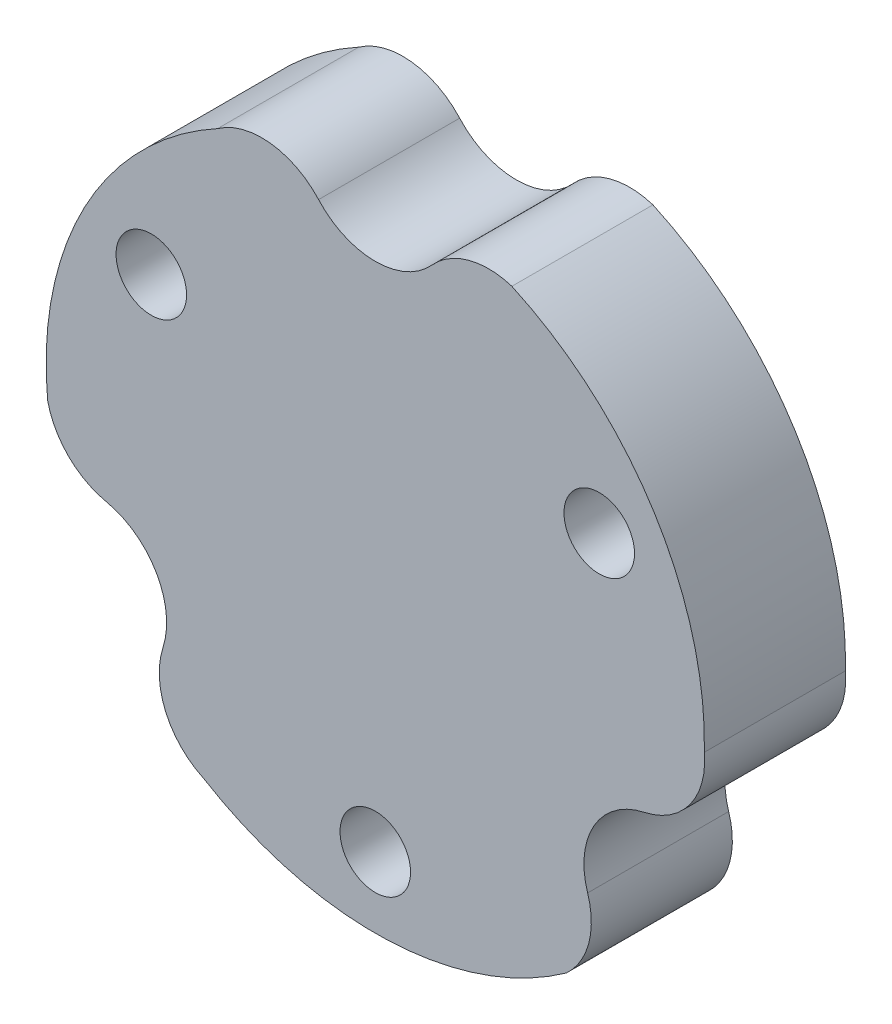
ISO-10303-21;
HEADER;
FILE_DESCRIPTION(('STEP AP214'),'2;1');
FILE_NAME('part.step','',(''),(''),'','','');
FILE_SCHEMA(('AUTOMOTIVE_DESIGN { 1 0 10303 214 1 1 1 1 }'));
ENDSEC;
DATA;
#1=APPLICATION_CONTEXT('core data for automotive mechanical design processes');
#2=APPLICATION_PROTOCOL_DEFINITION('international standard','automotive_design',2000,#1);
#3=PRODUCT_CONTEXT('',#1,'mechanical');
#4=PRODUCT('Part','Part','',(#3));
#5=PRODUCT_RELATED_PRODUCT_CATEGORY('part','',(#4));
#6=PRODUCT_DEFINITION_FORMATION('','',#4);
#7=PRODUCT_DEFINITION_CONTEXT('part definition',#1,'design');
#8=PRODUCT_DEFINITION('design','',#6,#7);
#9=PRODUCT_DEFINITION_SHAPE('','',#8);
#10=(LENGTH_UNIT() NAMED_UNIT(*) SI_UNIT(.MILLI.,.METRE.));
#11=(NAMED_UNIT(*) PLANE_ANGLE_UNIT() SI_UNIT($,.RADIAN.));
#12=(NAMED_UNIT(*) SI_UNIT($,.STERADIAN.) SOLID_ANGLE_UNIT());
#13=UNCERTAINTY_MEASURE_WITH_UNIT(LENGTH_MEASURE(1.E-05),#10,'distance_accuracy_value','');
#14=(GEOMETRIC_REPRESENTATION_CONTEXT(3) GLOBAL_UNCERTAINTY_ASSIGNED_CONTEXT((#13)) GLOBAL_UNIT_ASSIGNED_CONTEXT((#10,
#11,#12)) REPRESENTATION_CONTEXT('',''));
#15=CARTESIAN_POINT('',(0.,0.,0.));
#16=DIRECTION('',(0.,0.,1.));
#17=DIRECTION('',(1.,0.,0.));
#18=AXIS2_PLACEMENT_3D('',#15,#16,#17);
#19=CARTESIAN_POINT('',(5.38035373757222,-0.322325392410559,6.));
#20=DIRECTION('',(0.,0.,1.));
#21=DIRECTION('',(1.,0.,0.));
#22=AXIS2_PLACEMENT_3D('',#19,#20,#21);
#23=PLANE('',#22);
#24=CARTESIAN_POINT('',(0.,-11.,6.));
#25=DIRECTION('',(0.,0.,1.));
#26=DIRECTION('',(1.,0.,0.));
#27=AXIS2_PLACEMENT_3D('',#24,#25,#26);
#28=CIRCLE('',#27,1.5);
#29=CARTESIAN_POINT('',(1.5,-11.,6.));
#30=VERTEX_POINT('',#29);
#31=EDGE_CURVE('E286',#30,#30,#28,.T.);
#32=ORIENTED_EDGE('',*,*,#31,.F.);
#33=EDGE_LOOP('',(#32));
#34=FACE_BOUND('',#33,.T.);
#35=CARTESIAN_POINT('',(10.7607074751444,-0.644650784821117,6.));
#36=DIRECTION('',(0.,0.,1.));
#37=DIRECTION('',(1.,0.,0.));
#38=AXIS2_PLACEMENT_3D('',#35,#36,#37);
#39=CIRCLE('',#38,3.25);
#40=CARTESIAN_POINT('',(11.4425315640548,-3.82232539242045,6.));
#41=VERTEX_POINT('',#40);
#42=CARTESIAN_POINT('',(13.9959775932843,-0.335575935195618,6.));
#43=VERTEX_POINT('',#42);
#44=EDGE_CURVE('E177',#41,#43,#39,.T.);
#45=ORIENTED_EDGE('',*,*,#44,.T.);
#46=CARTESIAN_POINT('',(0.,0.,6.));
#47=DIRECTION('',(0.,0.,1.));
#48=DIRECTION('',(1.,0.,0.));
#49=AXIS2_PLACEMENT_3D('',#46,#47,#48);
#50=CIRCLE('',#49,14.);
#51=CARTESIAN_POINT('',(5.80943087987062,12.7377593340432,6.));
#52=VERTEX_POINT('',#51);
#53=EDGE_CURVE('E105',#43,#52,#50,.T.);
#54=ORIENTED_EDGE('',*,*,#53,.T.);
#55=CARTESIAN_POINT('',(4.82206978136234,9.64137142857136,6.));
#56=DIRECTION('',(0.,0.,1.));
#57=DIRECTION('',(1.,0.,0.));
#58=AXIS2_PLACEMENT_3D('',#55,#56,#57);
#59=CIRCLE('',#58,3.25);
#60=CARTESIAN_POINT('',(2.41103489067909,11.8206857142833,6.));
#61=VERTEX_POINT('',#60);
#62=EDGE_CURVE('E204',#52,#61,#59,.T.);
#63=ORIENTED_EDGE('',*,*,#62,.T.);
#64=CARTESIAN_POINT('',(1.07437023516552E-11,13.9999999999817,6.));
#65=DIRECTION('',(0.,0.,-1.));
#66=DIRECTION('',(1.,0.,0.));
#67=AXIS2_PLACEMENT_3D('',#64,#65,#66);
#68=CIRCLE('',#67,3.24999999997992);
#69=CARTESIAN_POINT('',(-2.41103489066096,11.820685714287,6.));
#70=VERTEX_POINT('',#69);
#71=EDGE_CURVE('E223',#61,#70,#68,.T.);
#72=ORIENTED_EDGE('',*,*,#71,.T.);
#73=CARTESIAN_POINT('',(-4.82206978134755,9.64137142857876,6.));
#74=DIRECTION('',(0.,0.,1.));
#75=DIRECTION('',(1.,0.,0.));
#76=AXIS2_PLACEMENT_3D('',#73,#74,#75);
#77=CIRCLE('',#76,3.25);
#78=CARTESIAN_POINT('',(-6.70737151186402,12.2886601141799,6.));
#79=VERTEX_POINT('',#78);
#80=EDGE_CURVE('E220',#70,#79,#77,.T.);
#81=ORIENTED_EDGE('',*,*,#80,.T.);
#82=CARTESIAN_POINT('',(0.,0.,6.));
#83=DIRECTION('',(0.,0.,1.));
#84=DIRECTION('',(1.,0.,0.));
#85=AXIS2_PLACEMENT_3D('',#82,#83,#84);
#86=CIRCLE('',#85,14.);
#87=CARTESIAN_POINT('',(-13.9359386105091,-1.33776494352389,6.));
#88=VERTEX_POINT('',#87);
#89=EDGE_CURVE('E222',#79,#88,#86,.T.);
#90=ORIENTED_EDGE('',*,*,#89,.T.);
#91=CARTESIAN_POINT('',(-10.7607074751454,-0.644650784804622,6.));
#92=DIRECTION('',(0.,0.,1.));
#93=DIRECTION('',(1.,0.,0.));
#94=AXIS2_PLACEMENT_3D('',#91,#92,#93);
#95=CIRCLE('',#94,3.25);
#96=CARTESIAN_POINT('',(-11.4425315640607,-3.82232539240291,6.));
#97=VERTEX_POINT('',#96);
#98=EDGE_CURVE('E225',#88,#97,#95,.T.);
#99=ORIENTED_EDGE('',*,*,#98,.T.);
#100=CARTESIAN_POINT('',(-12.1243556529717,-6.99999999998158,6.));
#101=DIRECTION('',(0.,0.,-1.));
#102=DIRECTION('',(1.,0.,0.));
#103=AXIS2_PLACEMENT_3D('',#100,#101,#102);
#104=CIRCLE('',#103,3.24999999997994);
#105=CARTESIAN_POINT('',(-9.03149667339383,-7.99836032186653,6.));
#106=VERTEX_POINT('',#105);
#107=EDGE_CURVE('E231',#97,#106,#104,.T.);
#108=ORIENTED_EDGE('',*,*,#107,.T.);
#109=CARTESIAN_POINT('',(-5.93863769379688,-8.99672064375764,6.));
#110=DIRECTION('',(0.,0.,1.));
#111=DIRECTION('',(1.,0.,0.));
#112=AXIS2_PLACEMENT_3D('',#109,#110,#111);
#113=CIRCLE('',#112,3.25);
#114=CARTESIAN_POINT('',(-7.28860608142029,-11.9530841789842,6.));
#115=VERTEX_POINT('',#114);
#116=EDGE_CURVE('E136',#106,#115,#113,.T.);
#117=ORIENTED_EDGE('',*,*,#116,.T.);
#118=CARTESIAN_POINT('',(0.,0.,6.));
#119=DIRECTION('',(0.,0.,1.));
#120=DIRECTION('',(1.,0.,0.));
#121=AXIS2_PLACEMENT_3D('',#118,#119,#120);
#122=CIRCLE('',#121,14.);
#123=CARTESIAN_POINT('',(8.12650773063849,-11.3999943905194,6.));
#124=VERTEX_POINT('',#123);
#125=EDGE_CURVE('E130',#115,#124,#122,.T.);
#126=ORIENTED_EDGE('',*,*,#125,.T.);
#127=CARTESIAN_POINT('',(5.93863769378309,-8.99672064376674,6.));
#128=DIRECTION('',(0.,0.,1.));
#129=DIRECTION('',(1.,0.,0.));
#130=AXIS2_PLACEMENT_3D('',#127,#128,#129);
#131=CIRCLE('',#130,3.25);
#132=CARTESIAN_POINT('',(9.03149667338157,-7.99836032188037,6.));
#133=VERTEX_POINT('',#132);
#134=EDGE_CURVE('E134',#124,#133,#131,.T.);
#135=ORIENTED_EDGE('',*,*,#134,.T.);
#136=CARTESIAN_POINT('',(12.124355652961,-7.00000000000017,6.));
#137=DIRECTION('',(0.,0.,-1.));
#138=DIRECTION('',(1.,0.,0.));
#139=AXIS2_PLACEMENT_3D('',#136,#137,#138);
#140=CIRCLE('',#139,3.24999999997994);
#141=EDGE_CURVE('E50',#133,#41,#140,.T.);
#142=ORIENTED_EDGE('',*,*,#141,.T.);
#143=EDGE_LOOP('',(#45,#54,#63,#72,#81,#90,#99,#108,#117,#126,#135,#142));
#144=FACE_BOUND('',#143,.T.);
#145=CARTESIAN_POINT('',(9.52627944162872,5.50000000000018,6.));
#146=DIRECTION('',(0.,0.,1.));
#147=DIRECTION('',(1.,0.,0.));
#148=AXIS2_PLACEMENT_3D('',#145,#146,#147);
#149=CIRCLE('',#148,1.5);
#150=CARTESIAN_POINT('',(11.0262794416287,5.50000000000018,6.));
#151=VERTEX_POINT('',#150);
#152=EDGE_CURVE('E158',#151,#151,#149,.T.);
#153=ORIENTED_EDGE('',*,*,#152,.F.);
#154=EDGE_LOOP('',(#153));
#155=FACE_BOUND('',#154,.T.);
#156=CARTESIAN_POINT('',(-9.52627944162887,5.49999999999991,6.));
#157=DIRECTION('',(0.,0.,1.));
#158=DIRECTION('',(1.,0.,0.));
#159=AXIS2_PLACEMENT_3D('',#156,#157,#158);
#160=CIRCLE('',#159,1.5);
#161=CARTESIAN_POINT('',(-8.02627944162888,5.49999999999991,6.));
#162=VERTEX_POINT('',#161);
#163=EDGE_CURVE('E277',#162,#162,#160,.T.);
#164=ORIENTED_EDGE('',*,*,#163,.F.);
#165=EDGE_LOOP('',(#164));
#166=FACE_BOUND('',#165,.T.);
#167=ADVANCED_FACE('F33',(#34,#144,#155,#166),#23,.T.);
#168=CARTESIAN_POINT('',(5.38035373757222,-0.322325392410559,0.));
#169=DIRECTION('',(0.,0.,1.));
#170=DIRECTION('',(1.,0.,0.));
#171=AXIS2_PLACEMENT_3D('',#168,#169,#170);
#172=PLANE('',#171);
#173=CARTESIAN_POINT('',(10.7607074751444,-0.644650784821117,0.));
#174=DIRECTION('',(0.,0.,1.));
#175=DIRECTION('',(1.,0.,0.));
#176=AXIS2_PLACEMENT_3D('',#173,#174,#175);
#177=CIRCLE('',#176,3.25);
#178=CARTESIAN_POINT('',(11.4425315640548,-3.82232539242045,0.));
#179=VERTEX_POINT('',#178);
#180=CARTESIAN_POINT('',(13.9959775932843,-0.335575935195618,0.));
#181=VERTEX_POINT('',#180);
#182=EDGE_CURVE('E154',#179,#181,#177,.T.);
#183=ORIENTED_EDGE('',*,*,#182,.F.);
#184=CARTESIAN_POINT('',(12.124355652961,-7.00000000000017,0.));
#185=DIRECTION('',(0.,0.,-1.));
#186=DIRECTION('',(1.,0.,0.));
#187=AXIS2_PLACEMENT_3D('',#184,#185,#186);
#188=CIRCLE('',#187,3.24999999997994);
#189=CARTESIAN_POINT('',(9.03149667338157,-7.99836032188037,0.));
#190=VERTEX_POINT('',#189);
#191=EDGE_CURVE('E97',#190,#179,#188,.T.);
#192=ORIENTED_EDGE('',*,*,#191,.F.);
#193=CARTESIAN_POINT('',(5.93863769378309,-8.99672064376674,0.));
#194=DIRECTION('',(0.,0.,1.));
#195=DIRECTION('',(1.,0.,0.));
#196=AXIS2_PLACEMENT_3D('',#193,#194,#195);
#197=CIRCLE('',#196,3.25);
#198=CARTESIAN_POINT('',(8.12650773063849,-11.3999943905194,0.));
#199=VERTEX_POINT('',#198);
#200=EDGE_CURVE('E91',#199,#190,#197,.T.);
#201=ORIENTED_EDGE('',*,*,#200,.F.);
#202=CARTESIAN_POINT('',(0.,0.,0.));
#203=DIRECTION('',(0.,0.,1.));
#204=DIRECTION('',(1.,0.,0.));
#205=AXIS2_PLACEMENT_3D('',#202,#203,#204);
#206=CIRCLE('',#205,14.);
#207=CARTESIAN_POINT('',(-7.28860608142029,-11.9530841789842,0.));
#208=VERTEX_POINT('',#207);
#209=EDGE_CURVE('E144',#208,#199,#206,.T.);
#210=ORIENTED_EDGE('',*,*,#209,.F.);
#211=CARTESIAN_POINT('',(-5.93863769379688,-8.99672064375764,0.));
#212=DIRECTION('',(0.,0.,1.));
#213=DIRECTION('',(1.,0.,0.));
#214=AXIS2_PLACEMENT_3D('',#211,#212,#213);
#215=CIRCLE('',#214,3.25);
#216=CARTESIAN_POINT('',(-9.03149667339383,-7.99836032186653,0.));
#217=VERTEX_POINT('',#216);
#218=EDGE_CURVE('E172',#217,#208,#215,.T.);
#219=ORIENTED_EDGE('',*,*,#218,.F.);
#220=CARTESIAN_POINT('',(-12.1243556529717,-6.99999999998158,0.));
#221=DIRECTION('',(0.,0.,-1.));
#222=DIRECTION('',(1.,0.,0.));
#223=AXIS2_PLACEMENT_3D('',#220,#221,#222);
#224=CIRCLE('',#223,3.24999999997994);
#225=CARTESIAN_POINT('',(-11.4425315640607,-3.82232539240291,0.));
#226=VERTEX_POINT('',#225);
#227=EDGE_CURVE('E170',#226,#217,#224,.T.);
#228=ORIENTED_EDGE('',*,*,#227,.F.);
#229=CARTESIAN_POINT('',(-10.7607074751454,-0.644650784804622,0.));
#230=DIRECTION('',(0.,0.,1.));
#231=DIRECTION('',(1.,0.,0.));
#232=AXIS2_PLACEMENT_3D('',#229,#230,#231);
#233=CIRCLE('',#232,3.25);
#234=CARTESIAN_POINT('',(-13.9359386105091,-1.33776494352389,0.));
#235=VERTEX_POINT('',#234);
#236=EDGE_CURVE('E168',#235,#226,#233,.T.);
#237=ORIENTED_EDGE('',*,*,#236,.F.);
#238=CARTESIAN_POINT('',(0.,0.,0.));
#239=DIRECTION('',(0.,0.,1.));
#240=DIRECTION('',(1.,0.,0.));
#241=AXIS2_PLACEMENT_3D('',#238,#239,#240);
#242=CIRCLE('',#241,14.);
#243=CARTESIAN_POINT('',(-6.70737151186402,12.2886601141799,0.));
#244=VERTEX_POINT('',#243);
#245=EDGE_CURVE('E166',#244,#235,#242,.T.);
#246=ORIENTED_EDGE('',*,*,#245,.F.);
#247=CARTESIAN_POINT('',(-4.82206978134755,9.64137142857876,0.));
#248=DIRECTION('',(0.,0.,1.));
#249=DIRECTION('',(1.,0.,0.));
#250=AXIS2_PLACEMENT_3D('',#247,#248,#249);
#251=CIRCLE('',#250,3.25);
#252=CARTESIAN_POINT('',(-2.41103489066096,11.820685714287,0.));
#253=VERTEX_POINT('',#252);
#254=EDGE_CURVE('E164',#253,#244,#251,.T.);
#255=ORIENTED_EDGE('',*,*,#254,.F.);
#256=CARTESIAN_POINT('',(1.07437023516552E-11,13.9999999999817,0.));
#257=DIRECTION('',(0.,0.,-1.));
#258=DIRECTION('',(1.,0.,0.));
#259=AXIS2_PLACEMENT_3D('',#256,#257,#258);
#260=CIRCLE('',#259,3.24999999997992);
#261=CARTESIAN_POINT('',(2.41103489067909,11.8206857142833,0.));
#262=VERTEX_POINT('',#261);
#263=EDGE_CURVE('E162',#262,#253,#260,.T.);
#264=ORIENTED_EDGE('',*,*,#263,.F.);
#265=CARTESIAN_POINT('',(4.82206978136234,9.64137142857136,0.));
#266=DIRECTION('',(0.,0.,1.));
#267=DIRECTION('',(1.,0.,0.));
#268=AXIS2_PLACEMENT_3D('',#265,#266,#267);
#269=CIRCLE('',#268,3.25);
#270=CARTESIAN_POINT('',(5.80943087987062,12.7377593340432,0.));
#271=VERTEX_POINT('',#270);
#272=EDGE_CURVE('E160',#271,#262,#269,.T.);
#273=ORIENTED_EDGE('',*,*,#272,.F.);
#274=CARTESIAN_POINT('',(0.,0.,0.));
#275=DIRECTION('',(0.,0.,1.));
#276=DIRECTION('',(1.,0.,0.));
#277=AXIS2_PLACEMENT_3D('',#274,#275,#276);
#278=CIRCLE('',#277,14.);
#279=EDGE_CURVE('E157',#181,#271,#278,.T.);
#280=ORIENTED_EDGE('',*,*,#279,.F.);
#281=EDGE_LOOP('',(#183,#192,#201,#210,#219,#228,#237,#246,#255,#264,#273,#280));
#282=FACE_BOUND('',#281,.T.);
#283=CARTESIAN_POINT('',(9.52627944162872,5.50000000000018,0.));
#284=DIRECTION('',(0.,0.,1.));
#285=DIRECTION('',(1.,0.,0.));
#286=AXIS2_PLACEMENT_3D('',#283,#284,#285);
#287=CIRCLE('',#286,1.5);
#288=CARTESIAN_POINT('',(11.0262794416287,5.50000000000018,0.));
#289=VERTEX_POINT('',#288);
#290=EDGE_CURVE('E289',#289,#289,#287,.T.);
#291=ORIENTED_EDGE('',*,*,#290,.T.);
#292=EDGE_LOOP('',(#291));
#293=FACE_BOUND('',#292,.T.);
#294=CARTESIAN_POINT('',(0.,-11.,0.));
#295=DIRECTION('',(0.,0.,1.));
#296=DIRECTION('',(1.,0.,0.));
#297=AXIS2_PLACEMENT_3D('',#294,#295,#296);
#298=CIRCLE('',#297,1.5);
#299=CARTESIAN_POINT('',(1.5,-11.,0.));
#300=VERTEX_POINT('',#299);
#301=EDGE_CURVE('E283',#300,#300,#298,.T.);
#302=ORIENTED_EDGE('',*,*,#301,.T.);
#303=EDGE_LOOP('',(#302));
#304=FACE_BOUND('',#303,.T.);
#305=CARTESIAN_POINT('',(-9.52627944162887,5.49999999999991,0.));
#306=DIRECTION('',(0.,0.,1.));
#307=DIRECTION('',(1.,0.,0.));
#308=AXIS2_PLACEMENT_3D('',#305,#306,#307);
#309=CIRCLE('',#308,1.5);
#310=CARTESIAN_POINT('',(-8.02627944162888,5.49999999999991,0.));
#311=VERTEX_POINT('',#310);
#312=EDGE_CURVE('E280',#311,#311,#309,.T.);
#313=ORIENTED_EDGE('',*,*,#312,.T.);
#314=EDGE_LOOP('',(#313));
#315=FACE_BOUND('',#314,.T.);
#316=ADVANCED_FACE('F208',(#282,#293,#304,#315),#172,.F.);
#317=CARTESIAN_POINT('',(10.7607074751444,-0.644650784821117,6.));
#318=DIRECTION('',(0.,0.,-1.));
#319=DIRECTION('',(-1.,0.,0.));
#320=AXIS2_PLACEMENT_3D('',#317,#318,#319);
#321=CYLINDRICAL_SURFACE('',#320,3.25);
#322=ORIENTED_EDGE('',*,*,#182,.T.);
#323=DIRECTION('',(0.,0.,-1.));
#324=VECTOR('',#323,1.);
#325=CARTESIAN_POINT('',(13.9959775932843,-0.335575935195618,6.));
#326=LINE('',#325,#324);
#327=EDGE_CURVE('E11',#43,#181,#326,.T.);
#328=ORIENTED_EDGE('',*,*,#327,.F.);
#329=ORIENTED_EDGE('',*,*,#44,.F.);
#330=DIRECTION('',(0.,0.,-1.));
#331=VECTOR('',#330,1.);
#332=CARTESIAN_POINT('',(11.4425315640548,-3.82232539242045,6.));
#333=LINE('',#332,#331);
#334=EDGE_CURVE('E150',#41,#179,#333,.T.);
#335=ORIENTED_EDGE('',*,*,#334,.T.);
#336=EDGE_LOOP('',(#322,#328,#329,#335));
#337=FACE_BOUND('',#336,.T.);
#338=ADVANCED_FACE('F35',(#337),#321,.T.);
#339=CARTESIAN_POINT('',(0.,0.,6.));
#340=DIRECTION('',(0.,0.,-1.));
#341=DIRECTION('',(-1.,0.,0.));
#342=AXIS2_PLACEMENT_3D('',#339,#340,#341);
#343=CYLINDRICAL_SURFACE('',#342,14.);
#344=ORIENTED_EDGE('',*,*,#279,.T.);
#345=DIRECTION('',(0.,0.,-1.));
#346=VECTOR('',#345,1.);
#347=CARTESIAN_POINT('',(5.80943087987062,12.7377593340432,6.));
#348=LINE('',#347,#346);
#349=EDGE_CURVE('E42',#52,#271,#348,.T.);
#350=ORIENTED_EDGE('',*,*,#349,.F.);
#351=ORIENTED_EDGE('',*,*,#53,.F.);
#352=ORIENTED_EDGE('',*,*,#327,.T.);
#353=EDGE_LOOP('',(#344,#350,#351,#352));
#354=FACE_BOUND('',#353,.T.);
#355=ADVANCED_FACE('F391',(#354),#343,.T.);
#356=CARTESIAN_POINT('',(4.82206978136234,9.64137142857136,6.));
#357=DIRECTION('',(0.,0.,-1.));
#358=DIRECTION('',(-1.,0.,0.));
#359=AXIS2_PLACEMENT_3D('',#356,#357,#358);
#360=CYLINDRICAL_SURFACE('',#359,3.25);
#361=ORIENTED_EDGE('',*,*,#272,.T.);
#362=DIRECTION('',(0.,0.,-1.));
#363=VECTOR('',#362,1.);
#364=CARTESIAN_POINT('',(2.41103489067909,11.8206857142833,6.));
#365=LINE('',#364,#363);
#366=EDGE_CURVE('E196',#61,#262,#365,.T.);
#367=ORIENTED_EDGE('',*,*,#366,.F.);
#368=ORIENTED_EDGE('',*,*,#62,.F.);
#369=ORIENTED_EDGE('',*,*,#349,.T.);
#370=EDGE_LOOP('',(#361,#367,#368,#369));
#371=FACE_BOUND('',#370,.T.);
#372=ADVANCED_FACE('F202',(#371),#360,.T.);
#373=CARTESIAN_POINT('',(1.07437023516552E-11,13.9999999999817,6.));
#374=DIRECTION('',(0.,0.,-1.));
#375=DIRECTION('',(-1.,0.,0.));
#376=AXIS2_PLACEMENT_3D('',#373,#374,#375);
#377=CYLINDRICAL_SURFACE('',#376,3.24999999997992);
#378=ORIENTED_EDGE('',*,*,#263,.T.);
#379=DIRECTION('',(0.,0.,-1.));
#380=VECTOR('',#379,1.);
#381=CARTESIAN_POINT('',(-2.41103489066096,11.820685714287,6.));
#382=LINE('',#381,#380);
#383=EDGE_CURVE('E193',#70,#253,#382,.T.);
#384=ORIENTED_EDGE('',*,*,#383,.F.);
#385=ORIENTED_EDGE('',*,*,#71,.F.);
#386=ORIENTED_EDGE('',*,*,#366,.T.);
#387=EDGE_LOOP('',(#378,#384,#385,#386));
#388=FACE_BOUND('',#387,.T.);
#389=ADVANCED_FACE('F214',(#388),#377,.F.);
#390=CARTESIAN_POINT('',(-4.82206978134755,9.64137142857876,6.));
#391=DIRECTION('',(0.,0.,-1.));
#392=DIRECTION('',(-1.,0.,0.));
#393=AXIS2_PLACEMENT_3D('',#390,#391,#392);
#394=CYLINDRICAL_SURFACE('',#393,3.25);
#395=ORIENTED_EDGE('',*,*,#254,.T.);
#396=DIRECTION('',(0.,0.,-1.));
#397=VECTOR('',#396,1.);
#398=CARTESIAN_POINT('',(-6.70737151186402,12.2886601141799,6.));
#399=LINE('',#398,#397);
#400=EDGE_CURVE('E190',#79,#244,#399,.T.);
#401=ORIENTED_EDGE('',*,*,#400,.F.);
#402=ORIENTED_EDGE('',*,*,#80,.F.);
#403=ORIENTED_EDGE('',*,*,#383,.T.);
#404=EDGE_LOOP('',(#395,#401,#402,#403));
#405=FACE_BOUND('',#404,.T.);
#406=ADVANCED_FACE('F218',(#405),#394,.T.);
#407=CARTESIAN_POINT('',(0.,0.,6.));
#408=DIRECTION('',(0.,0.,-1.));
#409=DIRECTION('',(-1.,0.,0.));
#410=AXIS2_PLACEMENT_3D('',#407,#408,#409);
#411=CYLINDRICAL_SURFACE('',#410,14.);
#412=ORIENTED_EDGE('',*,*,#245,.T.);
#413=DIRECTION('',(0.,0.,-1.));
#414=VECTOR('',#413,1.);
#415=CARTESIAN_POINT('',(-13.9359386105091,-1.33776494352389,6.));
#416=LINE('',#415,#414);
#417=EDGE_CURVE('E187',#88,#235,#416,.T.);
#418=ORIENTED_EDGE('',*,*,#417,.F.);
#419=ORIENTED_EDGE('',*,*,#89,.F.);
#420=ORIENTED_EDGE('',*,*,#400,.T.);
#421=EDGE_LOOP('',(#412,#418,#419,#420));
#422=FACE_BOUND('',#421,.T.);
#423=ADVANCED_FACE('F356',(#422),#411,.T.);
#424=CARTESIAN_POINT('',(-10.7607074751454,-0.644650784804622,6.));
#425=DIRECTION('',(0.,0.,-1.));
#426=DIRECTION('',(-1.,0.,0.));
#427=AXIS2_PLACEMENT_3D('',#424,#425,#426);
#428=CYLINDRICAL_SURFACE('',#427,3.25);
#429=ORIENTED_EDGE('',*,*,#236,.T.);
#430=DIRECTION('',(0.,0.,-1.));
#431=VECTOR('',#430,1.);
#432=CARTESIAN_POINT('',(-11.4425315640607,-3.82232539240291,6.));
#433=LINE('',#432,#431);
#434=EDGE_CURVE('E184',#97,#226,#433,.T.);
#435=ORIENTED_EDGE('',*,*,#434,.F.);
#436=ORIENTED_EDGE('',*,*,#98,.F.);
#437=ORIENTED_EDGE('',*,*,#417,.T.);
#438=EDGE_LOOP('',(#429,#435,#436,#437));
#439=FACE_BOUND('',#438,.T.);
#440=ADVANCED_FACE('F347',(#439),#428,.T.);
#441=CARTESIAN_POINT('',(-12.1243556529717,-6.99999999998158,6.));
#442=DIRECTION('',(0.,0.,-1.));
#443=DIRECTION('',(-1.,0.,0.));
#444=AXIS2_PLACEMENT_3D('',#441,#442,#443);
#445=CYLINDRICAL_SURFACE('',#444,3.24999999997994);
#446=ORIENTED_EDGE('',*,*,#227,.T.);
#447=DIRECTION('',(0.,0.,-1.));
#448=VECTOR('',#447,1.);
#449=CARTESIAN_POINT('',(-9.03149667339383,-7.99836032186653,6.));
#450=LINE('',#449,#448);
#451=EDGE_CURVE('E181',#106,#217,#450,.T.);
#452=ORIENTED_EDGE('',*,*,#451,.F.);
#453=ORIENTED_EDGE('',*,*,#107,.F.);
#454=ORIENTED_EDGE('',*,*,#434,.T.);
#455=EDGE_LOOP('',(#446,#452,#453,#454));
#456=FACE_BOUND('',#455,.T.);
#457=ADVANCED_FACE('F237',(#456),#445,.F.);
#458=CARTESIAN_POINT('',(-5.93863769379688,-8.99672064375764,6.));
#459=DIRECTION('',(0.,0.,-1.));
#460=DIRECTION('',(-1.,0.,0.));
#461=AXIS2_PLACEMENT_3D('',#458,#459,#460);
#462=CYLINDRICAL_SURFACE('',#461,3.25);
#463=ORIENTED_EDGE('',*,*,#218,.T.);
#464=DIRECTION('',(0.,0.,-1.));
#465=VECTOR('',#464,1.);
#466=CARTESIAN_POINT('',(-7.28860608142029,-11.9530841789842,6.));
#467=LINE('',#466,#465);
#468=EDGE_CURVE('E145',#115,#208,#467,.T.);
#469=ORIENTED_EDGE('',*,*,#468,.F.);
#470=ORIENTED_EDGE('',*,*,#116,.F.);
#471=ORIENTED_EDGE('',*,*,#451,.T.);
#472=EDGE_LOOP('',(#463,#469,#470,#471));
#473=FACE_BOUND('',#472,.T.);
#474=ADVANCED_FACE('F241',(#473),#462,.T.);
#475=CARTESIAN_POINT('',(0.,0.,6.));
#476=DIRECTION('',(0.,0.,-1.));
#477=DIRECTION('',(-1.,0.,0.));
#478=AXIS2_PLACEMENT_3D('',#475,#476,#477);
#479=CYLINDRICAL_SURFACE('',#478,14.);
#480=ORIENTED_EDGE('',*,*,#209,.T.);
#481=DIRECTION('',(0.,0.,-1.));
#482=VECTOR('',#481,1.);
#483=CARTESIAN_POINT('',(8.12650773063849,-11.3999943905194,6.));
#484=LINE('',#483,#482);
#485=EDGE_CURVE('E141',#124,#199,#484,.T.);
#486=ORIENTED_EDGE('',*,*,#485,.F.);
#487=ORIENTED_EDGE('',*,*,#125,.F.);
#488=ORIENTED_EDGE('',*,*,#468,.T.);
#489=EDGE_LOOP('',(#480,#486,#487,#488));
#490=FACE_BOUND('',#489,.T.);
#491=ADVANCED_FACE('F142',(#490),#479,.T.);
#492=CARTESIAN_POINT('',(5.93863769378309,-8.99672064376674,6.));
#493=DIRECTION('',(0.,0.,-1.));
#494=DIRECTION('',(-1.,0.,0.));
#495=AXIS2_PLACEMENT_3D('',#492,#493,#494);
#496=CYLINDRICAL_SURFACE('',#495,3.25);
#497=ORIENTED_EDGE('',*,*,#200,.T.);
#498=DIRECTION('',(0.,0.,-1.));
#499=VECTOR('',#498,1.);
#500=CARTESIAN_POINT('',(9.03149667338157,-7.99836032188037,6.));
#501=LINE('',#500,#499);
#502=EDGE_CURVE('E146',#133,#190,#501,.T.);
#503=ORIENTED_EDGE('',*,*,#502,.F.);
#504=ORIENTED_EDGE('',*,*,#134,.F.);
#505=ORIENTED_EDGE('',*,*,#485,.T.);
#506=EDGE_LOOP('',(#497,#503,#504,#505));
#507=FACE_BOUND('',#506,.T.);
#508=ADVANCED_FACE('F148',(#507),#496,.T.);
#509=CARTESIAN_POINT('',(12.124355652961,-7.00000000000017,6.));
#510=DIRECTION('',(0.,0.,-1.));
#511=DIRECTION('',(-1.,0.,0.));
#512=AXIS2_PLACEMENT_3D('',#509,#510,#511);
#513=CYLINDRICAL_SURFACE('',#512,3.24999999997994);
#514=ORIENTED_EDGE('',*,*,#191,.T.);
#515=ORIENTED_EDGE('',*,*,#334,.F.);
#516=ORIENTED_EDGE('',*,*,#141,.F.);
#517=ORIENTED_EDGE('',*,*,#502,.T.);
#518=EDGE_LOOP('',(#514,#515,#516,#517));
#519=FACE_BOUND('',#518,.T.);
#520=ADVANCED_FACE('F245',(#519),#513,.F.);
#521=CARTESIAN_POINT('',(9.52627944162872,5.50000000000018,6.));
#522=DIRECTION('',(0.,0.,-1.));
#523=DIRECTION('',(-1.,0.,0.));
#524=AXIS2_PLACEMENT_3D('',#521,#522,#523);
#525=CYLINDRICAL_SURFACE('',#524,1.5);
#526=ORIENTED_EDGE('',*,*,#152,.T.);
#527=EDGE_LOOP('',(#526));
#528=FACE_BOUND('',#527,.T.);
#529=ORIENTED_EDGE('',*,*,#290,.F.);
#530=EDGE_LOOP('',(#529));
#531=FACE_BOUND('',#530,.T.);
#532=ADVANCED_FACE('F247',(#528,#531),#525,.F.);
#533=CARTESIAN_POINT('',(0.,-11.,6.));
#534=DIRECTION('',(0.,0.,-1.));
#535=DIRECTION('',(-1.,0.,0.));
#536=AXIS2_PLACEMENT_3D('',#533,#534,#535);
#537=CYLINDRICAL_SURFACE('',#536,1.5);
#538=ORIENTED_EDGE('',*,*,#31,.T.);
#539=EDGE_LOOP('',(#538));
#540=FACE_BOUND('',#539,.T.);
#541=ORIENTED_EDGE('',*,*,#301,.F.);
#542=EDGE_LOOP('',(#541));
#543=FACE_BOUND('',#542,.T.);
#544=ADVANCED_FACE('F253',(#540,#543),#537,.F.);
#545=CARTESIAN_POINT('',(-9.52627944162887,5.49999999999991,6.));
#546=DIRECTION('',(0.,0.,-1.));
#547=DIRECTION('',(-1.,0.,0.));
#548=AXIS2_PLACEMENT_3D('',#545,#546,#547);
#549=CYLINDRICAL_SURFACE('',#548,1.5);
#550=ORIENTED_EDGE('',*,*,#163,.T.);
#551=EDGE_LOOP('',(#550));
#552=FACE_BOUND('',#551,.T.);
#553=ORIENTED_EDGE('',*,*,#312,.F.);
#554=EDGE_LOOP('',(#553));
#555=FACE_BOUND('',#554,.T.);
#556=ADVANCED_FACE('F268',(#552,#555),#549,.F.);
#557=CLOSED_SHELL('',(#167,#316,#338,#355,#372,#389,#406,#423,#440,#457,#474,#491,#508,#520,
#532,#544,#556));
#558=MANIFOLD_SOLID_BREP('B2',#557);
#559=ADVANCED_BREP_SHAPE_REPRESENTATION('',(#18,#558),#14);
#560=SHAPE_DEFINITION_REPRESENTATION(#9,#559);
ENDSEC;
END-ISO-10303-21;
